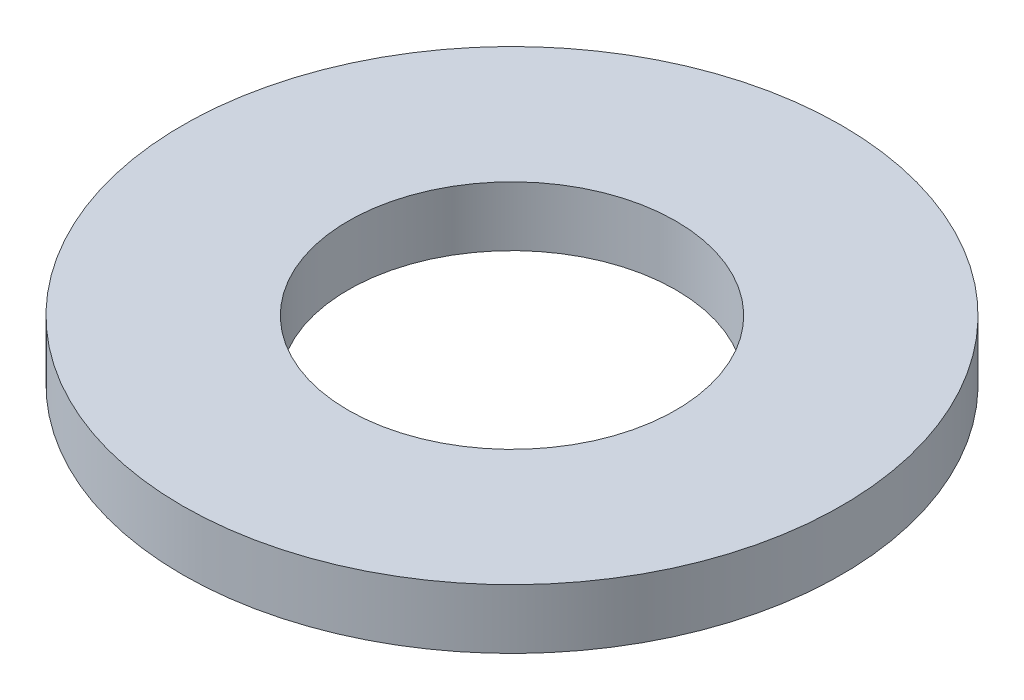
ISO-10303-21;
HEADER;
FILE_DESCRIPTION(('STEP AP214'),'2;1');
FILE_NAME('part.step','',(''),(''),'','','');
FILE_SCHEMA(('AUTOMOTIVE_DESIGN { 1 0 10303 214 1 1 1 1 }'));
ENDSEC;
DATA;
#1=APPLICATION_CONTEXT('core data for automotive mechanical design processes');
#2=APPLICATION_PROTOCOL_DEFINITION('international standard','automotive_design',2000,#1);
#3=PRODUCT_CONTEXT('',#1,'mechanical');
#4=PRODUCT('Part','Part','',(#3));
#5=PRODUCT_RELATED_PRODUCT_CATEGORY('part','',(#4));
#6=PRODUCT_DEFINITION_FORMATION('','',#4);
#7=PRODUCT_DEFINITION_CONTEXT('part definition',#1,'design');
#8=PRODUCT_DEFINITION('design','',#6,#7);
#9=PRODUCT_DEFINITION_SHAPE('','',#8);
#10=(LENGTH_UNIT() NAMED_UNIT(*) SI_UNIT(.MILLI.,.METRE.));
#11=(NAMED_UNIT(*) PLANE_ANGLE_UNIT() SI_UNIT($,.RADIAN.));
#12=(NAMED_UNIT(*) SI_UNIT($,.STERADIAN.) SOLID_ANGLE_UNIT());
#13=UNCERTAINTY_MEASURE_WITH_UNIT(LENGTH_MEASURE(1.E-05),#10,'distance_accuracy_value','');
#14=(GEOMETRIC_REPRESENTATION_CONTEXT(3) GLOBAL_UNCERTAINTY_ASSIGNED_CONTEXT((#13)) GLOBAL_UNIT_ASSIGNED_CONTEXT((#10,
#11,#12)) REPRESENTATION_CONTEXT('',''));
#15=CARTESIAN_POINT('',(0.,0.,0.));
#16=DIRECTION('',(0.,0.,1.));
#17=DIRECTION('',(1.,0.,0.));
#18=AXIS2_PLACEMENT_3D('',#15,#16,#17);
#19=CARTESIAN_POINT('',(0.,0.8,0.));
#20=DIRECTION('',(0.,1.,0.));
#21=DIRECTION('',(0.,0.,1.));
#22=AXIS2_PLACEMENT_3D('',#19,#20,#21);
#23=PLANE('',#22);
#24=CARTESIAN_POINT('',(0.,0.8,0.));
#25=DIRECTION('',(0.,1.,0.));
#26=DIRECTION('',(0.,0.,1.));
#27=AXIS2_PLACEMENT_3D('',#24,#25,#26);
#28=CIRCLE('',#27,4.425);
#29=CARTESIAN_POINT('',(0.,0.8,4.425));
#30=VERTEX_POINT('',#29);
#31=EDGE_CURVE('E10',#30,#30,#28,.T.);
#32=ORIENTED_EDGE('',*,*,#31,.T.);
#33=EDGE_LOOP('',(#32));
#34=FACE_BOUND('',#33,.T.);
#35=CARTESIAN_POINT('',(0.,0.8,0.));
#36=DIRECTION('',(0.,1.,0.));
#37=DIRECTION('',(0.,0.,1.));
#38=AXIS2_PLACEMENT_3D('',#35,#36,#37);
#39=CIRCLE('',#38,2.2);
#40=CARTESIAN_POINT('',(0.,0.8,2.2));
#41=VERTEX_POINT('',#40);
#42=EDGE_CURVE('E42',#41,#41,#39,.T.);
#43=ORIENTED_EDGE('',*,*,#42,.F.);
#44=EDGE_LOOP('',(#43));
#45=FACE_BOUND('',#44,.T.);
#46=ADVANCED_FACE('F31',(#34,#45),#23,.T.);
#47=CARTESIAN_POINT('',(0.,0.,0.));
#48=DIRECTION('',(0.,1.,0.));
#49=DIRECTION('',(0.,0.,1.));
#50=AXIS2_PLACEMENT_3D('',#47,#48,#49);
#51=PLANE('',#50);
#52=CARTESIAN_POINT('',(0.,0.,0.));
#53=DIRECTION('',(0.,1.,0.));
#54=DIRECTION('',(0.,0.,1.));
#55=AXIS2_PLACEMENT_3D('',#52,#53,#54);
#56=CIRCLE('',#55,4.425);
#57=CARTESIAN_POINT('',(0.,0.,4.425));
#58=VERTEX_POINT('',#57);
#59=EDGE_CURVE('E35',#58,#58,#56,.T.);
#60=ORIENTED_EDGE('',*,*,#59,.F.);
#61=EDGE_LOOP('',(#60));
#62=FACE_BOUND('',#61,.T.);
#63=CARTESIAN_POINT('',(0.,0.,0.));
#64=DIRECTION('',(0.,1.,0.));
#65=DIRECTION('',(0.,0.,1.));
#66=AXIS2_PLACEMENT_3D('',#63,#64,#65);
#67=CIRCLE('',#66,2.2);
#68=CARTESIAN_POINT('',(0.,0.,2.2));
#69=VERTEX_POINT('',#68);
#70=EDGE_CURVE('E44',#69,#69,#67,.T.);
#71=ORIENTED_EDGE('',*,*,#70,.T.);
#72=EDGE_LOOP('',(#71));
#73=FACE_BOUND('',#72,.T.);
#74=ADVANCED_FACE('F54',(#62,#73),#51,.F.);
#75=CARTESIAN_POINT('',(0.,0.8,0.));
#76=DIRECTION('',(0.,-1.,0.));
#77=DIRECTION('',(0.,0.,-1.));
#78=AXIS2_PLACEMENT_3D('',#75,#76,#77);
#79=CYLINDRICAL_SURFACE('',#78,4.425);
#80=ORIENTED_EDGE('',*,*,#31,.F.);
#81=EDGE_LOOP('',(#80));
#82=FACE_BOUND('',#81,.T.);
#83=ORIENTED_EDGE('',*,*,#59,.T.);
#84=EDGE_LOOP('',(#83));
#85=FACE_BOUND('',#84,.T.);
#86=ADVANCED_FACE('F33',(#82,#85),#79,.T.);
#87=CARTESIAN_POINT('',(0.,0.8,0.));
#88=DIRECTION('',(0.,-1.,0.));
#89=DIRECTION('',(0.,0.,-1.));
#90=AXIS2_PLACEMENT_3D('',#87,#88,#89);
#91=CYLINDRICAL_SURFACE('',#90,2.2);
#92=ORIENTED_EDGE('',*,*,#42,.T.);
#93=EDGE_LOOP('',(#92));
#94=FACE_BOUND('',#93,.T.);
#95=ORIENTED_EDGE('',*,*,#70,.F.);
#96=EDGE_LOOP('',(#95));
#97=FACE_BOUND('',#96,.T.);
#98=ADVANCED_FACE('F50',(#94,#97),#91,.F.);
#99=CLOSED_SHELL('',(#46,#74,#86,#98));
#100=MANIFOLD_SOLID_BREP('B2',#99);
#101=ADVANCED_BREP_SHAPE_REPRESENTATION('',(#18,#100),#14);
#102=SHAPE_DEFINITION_REPRESENTATION(#9,#101);
ENDSEC;
END-ISO-10303-21;
